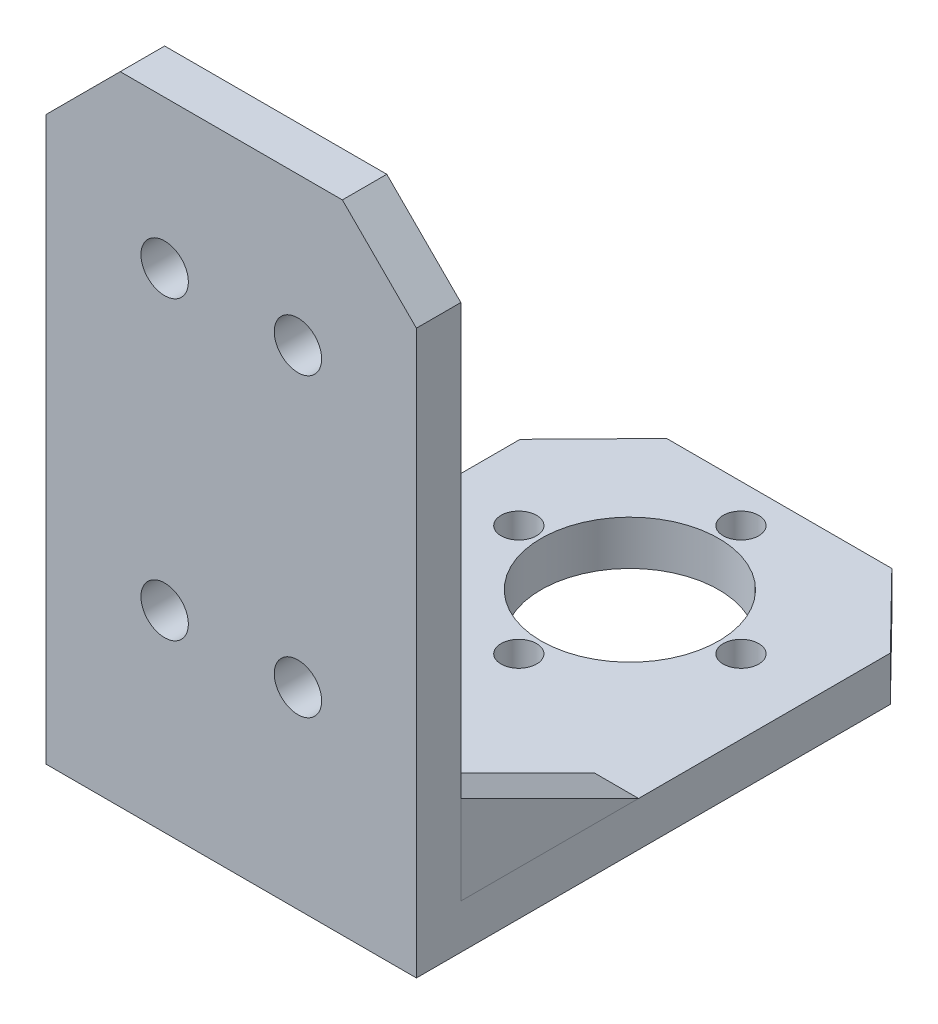
ISO-10303-21;
HEADER;
FILE_DESCRIPTION(('STEP AP214'),'2;1');
FILE_NAME('part.step','',(''),(''),'','','');
FILE_SCHEMA(('AUTOMOTIVE_DESIGN { 1 0 10303 214 1 1 1 1 }'));
ENDSEC;
DATA;
#1=APPLICATION_CONTEXT('core data for automotive mechanical design processes');
#2=APPLICATION_PROTOCOL_DEFINITION('international standard','automotive_design',2000,#1);
#3=PRODUCT_CONTEXT('',#1,'mechanical');
#4=PRODUCT('Part','Part','',(#3));
#5=PRODUCT_RELATED_PRODUCT_CATEGORY('part','',(#4));
#6=PRODUCT_DEFINITION_FORMATION('','',#4);
#7=PRODUCT_DEFINITION_CONTEXT('part definition',#1,'design');
#8=PRODUCT_DEFINITION('design','',#6,#7);
#9=PRODUCT_DEFINITION_SHAPE('','',#8);
#10=(LENGTH_UNIT() NAMED_UNIT(*) SI_UNIT(.MILLI.,.METRE.));
#11=(NAMED_UNIT(*) PLANE_ANGLE_UNIT() SI_UNIT($,.RADIAN.));
#12=(NAMED_UNIT(*) SI_UNIT($,.STERADIAN.) SOLID_ANGLE_UNIT());
#13=UNCERTAINTY_MEASURE_WITH_UNIT(LENGTH_MEASURE(1.E-05),#10,'distance_accuracy_value','');
#14=(GEOMETRIC_REPRESENTATION_CONTEXT(3) GLOBAL_UNCERTAINTY_ASSIGNED_CONTEXT((#13)) GLOBAL_UNIT_ASSIGNED_CONTEXT((#10,
#11,#12)) REPRESENTATION_CONTEXT('',''));
#15=CARTESIAN_POINT('',(0.,0.,0.));
#16=DIRECTION('',(0.,0.,1.));
#17=DIRECTION('',(1.,0.,0.));
#18=AXIS2_PLACEMENT_3D('',#15,#16,#17);
#19=CARTESIAN_POINT('',(-28.2810708538973,9.,50.7219917810053));
#20=DIRECTION('',(0.,-0.894427190999916,0.447213595499958));
#21=DIRECTION('',(0.,-0.447213595499958,-0.894427190999916));
#22=AXIS2_PLACEMENT_3D('',#19,#20,#21);
#23=PLANE('',#22);
#24=DIRECTION('',(0.,-0.447213595499958,-0.894427190999916));
#25=VECTOR('',#24,1.);
#26=CARTESIAN_POINT('',(-25.2810708538973,9.,50.7219917810053));
#27=LINE('',#26,#25);
#28=CARTESIAN_POINT('',(-25.2810708538973,9.,50.7219917810053));
#29=VERTEX_POINT('',#28);
#30=CARTESIAN_POINT('',(-25.2810708538973,3.,38.7219917810053));
#31=VERTEX_POINT('',#30);
#32=EDGE_CURVE('E92',#29,#31,#27,.T.);
#33=ORIENTED_EDGE('',*,*,#32,.T.);
#34=DIRECTION('',(1.,0.,0.));
#35=VECTOR('',#34,1.);
#36=CARTESIAN_POINT('',(-28.2810708538973,3.,38.7219917810053));
#37=LINE('',#36,#35);
#38=CARTESIAN_POINT('',(-28.2810708538973,3.,38.7219917810053));
#39=VERTEX_POINT('',#38);
#40=EDGE_CURVE('E12',#39,#31,#37,.T.);
#41=ORIENTED_EDGE('',*,*,#40,.F.);
#42=DIRECTION('',(0.,-0.447213595499958,-0.894427190999916));
#43=VECTOR('',#42,1.);
#44=CARTESIAN_POINT('',(-28.2810708538973,9.,50.7219917810053));
#45=LINE('',#44,#43);
#46=CARTESIAN_POINT('',(-28.2810708538973,9.,50.7219917810053));
#47=VERTEX_POINT('',#46);
#48=EDGE_CURVE('E85',#47,#39,#45,.T.);
#49=ORIENTED_EDGE('',*,*,#48,.F.);
#50=DIRECTION('',(1.,0.,0.));
#51=VECTOR('',#50,1.);
#52=CARTESIAN_POINT('',(-28.2810708538973,9.,50.7219917810053));
#53=LINE('',#52,#51);
#54=EDGE_CURVE('E93',#47,#29,#53,.T.);
#55=ORIENTED_EDGE('',*,*,#54,.T.);
#56=EDGE_LOOP('',(#33,#41,#49,#55));
#57=FACE_BOUND('',#56,.T.);
#58=ADVANCED_FACE('F45',(#57),#23,.F.);
#59=CARTESIAN_POINT('',(-28.2810708538973,3.,50.7219917810053));
#60=DIRECTION('',(0.,1.,0.));
#61=DIRECTION('',(0.,0.,1.));
#62=AXIS2_PLACEMENT_3D('',#59,#60,#61);
#63=PLANE('',#62);
#64=DIRECTION('',(0.,0.,1.));
#65=VECTOR('',#64,1.);
#66=CARTESIAN_POINT('',(-25.2810708538973,3.,50.7219917810053));
#67=LINE('',#66,#65);
#68=CARTESIAN_POINT('',(-25.2810708538973,3.,50.7219917810053));
#69=VERTEX_POINT('',#68);
#70=EDGE_CURVE('E73',#31,#69,#67,.T.);
#71=ORIENTED_EDGE('',*,*,#70,.T.);
#72=DIRECTION('',(1.,0.,0.));
#73=VECTOR('',#72,1.);
#74=CARTESIAN_POINT('',(-28.2810708538973,3.,50.7219917810053));
#75=LINE('',#74,#73);
#76=CARTESIAN_POINT('',(-28.2810708538973,3.,50.7219917810053));
#77=VERTEX_POINT('',#76);
#78=EDGE_CURVE('E53',#77,#69,#75,.T.);
#79=ORIENTED_EDGE('',*,*,#78,.F.);
#80=DIRECTION('',(0.,0.,1.));
#81=VECTOR('',#80,1.);
#82=CARTESIAN_POINT('',(-28.2810708538973,3.,50.7219917810053));
#83=LINE('',#82,#81);
#84=EDGE_CURVE('E81',#39,#77,#83,.T.);
#85=ORIENTED_EDGE('',*,*,#84,.F.);
#86=ORIENTED_EDGE('',*,*,#40,.T.);
#87=EDGE_LOOP('',(#71,#79,#85,#86));
#88=FACE_BOUND('',#87,.T.);
#89=ADVANCED_FACE('F82',(#88),#63,.F.);
#90=CARTESIAN_POINT('',(-28.2810708538973,3.,50.7219917810053));
#91=DIRECTION('',(0.,0.,-1.));
#92=DIRECTION('',(-1.,0.,0.));
#93=AXIS2_PLACEMENT_3D('',#90,#91,#92);
#94=PLANE('',#93);
#95=DIRECTION('',(0.,1.,0.));
#96=VECTOR('',#95,1.);
#97=CARTESIAN_POINT('',(-25.2810708538973,3.,50.7219917810053));
#98=LINE('',#97,#96);
#99=EDGE_CURVE('E78',#69,#29,#98,.T.);
#100=ORIENTED_EDGE('',*,*,#99,.T.);
#101=ORIENTED_EDGE('',*,*,#54,.F.);
#102=DIRECTION('',(0.,1.,0.));
#103=VECTOR('',#102,1.);
#104=CARTESIAN_POINT('',(-28.2810708538973,3.,50.7219917810053));
#105=LINE('',#104,#103);
#106=EDGE_CURVE('E61',#77,#47,#105,.T.);
#107=ORIENTED_EDGE('',*,*,#106,.F.);
#108=ORIENTED_EDGE('',*,*,#78,.T.);
#109=EDGE_LOOP('',(#100,#101,#107,#108));
#110=FACE_BOUND('',#109,.T.);
#111=ADVANCED_FACE('F100',(#110),#94,.F.);
#112=CARTESIAN_POINT('',(-28.2810708538973,0.,0.));
#113=DIRECTION('',(1.,0.,0.));
#114=DIRECTION('',(0.,0.,-1.));
#115=AXIS2_PLACEMENT_3D('',#112,#113,#114);
#116=PLANE('',#115);
#117=ORIENTED_EDGE('',*,*,#48,.T.);
#118=ORIENTED_EDGE('',*,*,#84,.T.);
#119=ORIENTED_EDGE('',*,*,#106,.T.);
#120=EDGE_LOOP('',(#117,#118,#119));
#121=FACE_BOUND('',#120,.T.);
#122=ADVANCED_FACE('F88',(#121),#116,.F.);
#123=CARTESIAN_POINT('',(-25.2810708538973,0.,0.));
#124=DIRECTION('',(1.,0.,0.));
#125=DIRECTION('',(0.,0.,-1.));
#126=AXIS2_PLACEMENT_3D('',#123,#124,#125);
#127=PLANE('',#126);
#128=ORIENTED_EDGE('',*,*,#32,.F.);
#129=ORIENTED_EDGE('',*,*,#99,.F.);
#130=ORIENTED_EDGE('',*,*,#70,.F.);
#131=EDGE_LOOP('',(#128,#129,#130));
#132=FACE_BOUND('',#131,.T.);
#133=ADVANCED_FACE('F101',(#132),#127,.T.);
#134=CLOSED_SHELL('',(#58,#89,#111,#122,#133));
#135=MANIFOLD_SOLID_BREP('B2',#134);
#136=CARTESIAN_POINT('',(-47.2810708538973,3.,38.7219917810053));
#137=DIRECTION('',(0.,-0.894427190999916,0.447213595499958));
#138=DIRECTION('',(0.,-0.447213595499958,-0.894427190999916));
#139=AXIS2_PLACEMENT_3D('',#136,#137,#138);
#140=PLANE('',#139);
#141=DIRECTION('',(0.,0.447213595499958,0.894427190999916));
#142=VECTOR('',#141,1.);
#143=CARTESIAN_POINT('',(-50.2810708538973,3.,38.7219917810053));
#144=LINE('',#143,#142);
#145=CARTESIAN_POINT('',(-50.2810708538973,3.,38.7219917810053));
#146=VERTEX_POINT('',#145);
#147=CARTESIAN_POINT('',(-50.2810708538973,9.,50.7219917810053));
#148=VERTEX_POINT('',#147);
#149=EDGE_CURVE('E199',#146,#148,#144,.T.);
#150=ORIENTED_EDGE('',*,*,#149,.T.);
#151=DIRECTION('',(-1.,0.,0.));
#152=VECTOR('',#151,1.);
#153=CARTESIAN_POINT('',(-47.2810708538973,9.,50.7219917810053));
#154=LINE('',#153,#152);
#155=CARTESIAN_POINT('',(-47.2810708538973,9.,50.7219917810053));
#156=VERTEX_POINT('',#155);
#157=EDGE_CURVE('E43',#156,#148,#154,.T.);
#158=ORIENTED_EDGE('',*,*,#157,.F.);
#159=DIRECTION('',(0.,0.447213595499958,0.894427190999916));
#160=VECTOR('',#159,1.);
#161=CARTESIAN_POINT('',(-47.2810708538973,3.,38.7219917810053));
#162=LINE('',#161,#160);
#163=CARTESIAN_POINT('',(-47.2810708538973,3.,38.7219917810053));
#164=VERTEX_POINT('',#163);
#165=EDGE_CURVE('E192',#164,#156,#162,.T.);
#166=ORIENTED_EDGE('',*,*,#165,.F.);
#167=DIRECTION('',(-1.,0.,0.));
#168=VECTOR('',#167,1.);
#169=CARTESIAN_POINT('',(-47.2810708538973,3.,38.7219917810053));
#170=LINE('',#169,#168);
#171=EDGE_CURVE('E200',#164,#146,#170,.T.);
#172=ORIENTED_EDGE('',*,*,#171,.T.);
#173=EDGE_LOOP('',(#150,#158,#166,#172));
#174=FACE_BOUND('',#173,.T.);
#175=ADVANCED_FACE('F152',(#174),#140,.F.);
#176=CARTESIAN_POINT('',(-47.2810708538973,3.,50.7219917810053));
#177=DIRECTION('',(0.,0.,-1.));
#178=DIRECTION('',(-1.,0.,0.));
#179=AXIS2_PLACEMENT_3D('',#176,#177,#178);
#180=PLANE('',#179);
#181=DIRECTION('',(0.,-1.,0.));
#182=VECTOR('',#181,1.);
#183=CARTESIAN_POINT('',(-50.2810708538973,3.,50.7219917810053));
#184=LINE('',#183,#182);
#185=CARTESIAN_POINT('',(-50.2810708538973,3.,50.7219917810053));
#186=VERTEX_POINT('',#185);
#187=EDGE_CURVE('E180',#148,#186,#184,.T.);
#188=ORIENTED_EDGE('',*,*,#187,.T.);
#189=DIRECTION('',(-1.,0.,0.));
#190=VECTOR('',#189,1.);
#191=CARTESIAN_POINT('',(-47.2810708538973,3.,50.7219917810053));
#192=LINE('',#191,#190);
#193=CARTESIAN_POINT('',(-47.2810708538973,3.,50.7219917810053));
#194=VERTEX_POINT('',#193);
#195=EDGE_CURVE('E160',#194,#186,#192,.T.);
#196=ORIENTED_EDGE('',*,*,#195,.F.);
#197=DIRECTION('',(0.,-1.,0.));
#198=VECTOR('',#197,1.);
#199=CARTESIAN_POINT('',(-47.2810708538973,3.,50.7219917810053));
#200=LINE('',#199,#198);
#201=EDGE_CURVE('E188',#156,#194,#200,.T.);
#202=ORIENTED_EDGE('',*,*,#201,.F.);
#203=ORIENTED_EDGE('',*,*,#157,.T.);
#204=EDGE_LOOP('',(#188,#196,#202,#203));
#205=FACE_BOUND('',#204,.T.);
#206=ADVANCED_FACE('F189',(#205),#180,.F.);
#207=CARTESIAN_POINT('',(-47.2810708538973,3.,50.7219917810053));
#208=DIRECTION('',(0.,1.,0.));
#209=DIRECTION('',(0.,0.,1.));
#210=AXIS2_PLACEMENT_3D('',#207,#208,#209);
#211=PLANE('',#210);
#212=DIRECTION('',(0.,0.,-1.));
#213=VECTOR('',#212,1.);
#214=CARTESIAN_POINT('',(-50.2810708538973,3.,50.7219917810053));
#215=LINE('',#214,#213);
#216=EDGE_CURVE('E185',#186,#146,#215,.T.);
#217=ORIENTED_EDGE('',*,*,#216,.T.);
#218=ORIENTED_EDGE('',*,*,#171,.F.);
#219=DIRECTION('',(0.,0.,-1.));
#220=VECTOR('',#219,1.);
#221=CARTESIAN_POINT('',(-47.2810708538973,3.,50.7219917810053));
#222=LINE('',#221,#220);
#223=EDGE_CURVE('E168',#194,#164,#222,.T.);
#224=ORIENTED_EDGE('',*,*,#223,.F.);
#225=ORIENTED_EDGE('',*,*,#195,.T.);
#226=EDGE_LOOP('',(#217,#218,#224,#225));
#227=FACE_BOUND('',#226,.T.);
#228=ADVANCED_FACE('F207',(#227),#211,.F.);
#229=CARTESIAN_POINT('',(-47.2810708538973,0.,0.));
#230=DIRECTION('',(-1.,0.,0.));
#231=DIRECTION('',(0.,0.,1.));
#232=AXIS2_PLACEMENT_3D('',#229,#230,#231);
#233=PLANE('',#232);
#234=ORIENTED_EDGE('',*,*,#165,.T.);
#235=ORIENTED_EDGE('',*,*,#201,.T.);
#236=ORIENTED_EDGE('',*,*,#223,.T.);
#237=EDGE_LOOP('',(#234,#235,#236));
#238=FACE_BOUND('',#237,.T.);
#239=ADVANCED_FACE('F195',(#238),#233,.F.);
#240=CARTESIAN_POINT('',(-50.2810708538973,0.,0.));
#241=DIRECTION('',(-1.,0.,0.));
#242=DIRECTION('',(0.,0.,1.));
#243=AXIS2_PLACEMENT_3D('',#240,#241,#242);
#244=PLANE('',#243);
#245=ORIENTED_EDGE('',*,*,#149,.F.);
#246=ORIENTED_EDGE('',*,*,#216,.F.);
#247=ORIENTED_EDGE('',*,*,#187,.F.);
#248=EDGE_LOOP('',(#245,#246,#247));
#249=FACE_BOUND('',#248,.T.);
#250=ADVANCED_FACE('F208',(#249),#244,.T.);
#251=CLOSED_SHELL('',(#175,#206,#228,#239,#250));
#252=MANIFOLD_SOLID_BREP('B6',#251);
#253=CARTESIAN_POINT('',(0.,3.,0.));
#254=DIRECTION('',(0.,-1.,0.));
#255=DIRECTION('',(0.,0.,-1.));
#256=AXIS2_PLACEMENT_3D('',#253,#254,#255);
#257=PLANE('',#256);
#258=CARTESIAN_POINT('',(-30.2810708538972,3.,26.8074849511543));
#259=DIRECTION('',(0.,1.,0.));
#260=DIRECTION('',(0.,0.,1.));
#261=AXIS2_PLACEMENT_3D('',#258,#259,#260);
#262=CIRCLE('',#261,1.2);
#263=CARTESIAN_POINT('',(-30.2810708538972,3.,28.0074849511543));
#264=VERTEX_POINT('',#263);
#265=EDGE_CURVE('E352',#264,#264,#262,.T.);
#266=ORIENTED_EDGE('',*,*,#265,.F.);
#267=EDGE_LOOP('',(#266));
#268=FACE_BOUND('',#267,.T.);
#269=CARTESIAN_POINT('',(-37.7810708538972,3.,34.3074849511543));
#270=DIRECTION('',(0.,1.,0.));
#271=DIRECTION('',(0.,0.,1.));
#272=AXIS2_PLACEMENT_3D('',#269,#270,#271);
#273=CIRCLE('',#272,1.2);
#274=CARTESIAN_POINT('',(-37.7810708538972,3.,35.5074849511543));
#275=VERTEX_POINT('',#274);
#276=EDGE_CURVE('E360',#275,#275,#273,.T.);
#277=ORIENTED_EDGE('',*,*,#276,.F.);
#278=EDGE_LOOP('',(#277));
#279=FACE_BOUND('',#278,.T.);
#280=CARTESIAN_POINT('',(-45.2810708538972,3.,26.8074849511543));
#281=DIRECTION('',(0.,1.,0.));
#282=DIRECTION('',(0.,0.,1.));
#283=AXIS2_PLACEMENT_3D('',#280,#281,#282);
#284=CIRCLE('',#283,1.2);
#285=CARTESIAN_POINT('',(-45.2810708538972,3.,28.0074849511543));
#286=VERTEX_POINT('',#285);
#287=EDGE_CURVE('E366',#286,#286,#284,.T.);
#288=ORIENTED_EDGE('',*,*,#287,.F.);
#289=EDGE_LOOP('',(#288));
#290=FACE_BOUND('',#289,.T.);
#291=CARTESIAN_POINT('',(-37.7810708538972,3.,19.3074849511543));
#292=DIRECTION('',(0.,1.,0.));
#293=DIRECTION('',(0.,0.,1.));
#294=AXIS2_PLACEMENT_3D('',#291,#292,#293);
#295=CIRCLE('',#294,1.2);
#296=CARTESIAN_POINT('',(-37.7810708538972,3.,20.5074849511543));
#297=VERTEX_POINT('',#296);
#298=EDGE_CURVE('E372',#297,#297,#295,.T.);
#299=ORIENTED_EDGE('',*,*,#298,.F.);
#300=EDGE_LOOP('',(#299));
#301=FACE_BOUND('',#300,.T.);
#302=CARTESIAN_POINT('',(-37.7810708538972,3.,26.8074849511543));
#303=DIRECTION('',(0.,1.,0.));
#304=DIRECTION('',(0.,0.,1.));
#305=AXIS2_PLACEMENT_3D('',#302,#303,#304);
#306=CIRCLE('',#305,5.99999999999999);
#307=CARTESIAN_POINT('',(-37.7810708538972,3.,32.8074849511543));
#308=VERTEX_POINT('',#307);
#309=EDGE_CURVE('E378',#308,#308,#306,.T.);
#310=ORIENTED_EDGE('',*,*,#309,.F.);
#311=EDGE_LOOP('',(#310));
#312=FACE_BOUND('',#311,.T.);
#313=DIRECTION('',(-1.,0.,0.));
#314=VECTOR('',#313,1.);
#315=CARTESIAN_POINT('',(-50.2810708538973,3.,50.7219917810053));
#316=LINE('',#315,#314);
#317=CARTESIAN_POINT('',(-25.2810708538973,3.,50.7219917810053));
#318=VERTEX_POINT('',#317);
#319=CARTESIAN_POINT('',(-50.2810708538973,3.,50.7219917810053));
#320=VERTEX_POINT('',#319);
#321=EDGE_CURVE('E430',#318,#320,#316,.T.);
#322=ORIENTED_EDGE('',*,*,#321,.F.);
#323=DIRECTION('',(0.,0.,-1.));
#324=VECTOR('',#323,1.);
#325=CARTESIAN_POINT('',(-25.2810708538973,3.,21.7219917810053));
#326=LINE('',#325,#324);
#327=CARTESIAN_POINT('',(-25.2810708538973,3.,21.7219917810053));
#328=VERTEX_POINT('',#327);
#329=EDGE_CURVE('E347',#318,#328,#326,.T.);
#330=ORIENTED_EDGE('',*,*,#329,.T.);
#331=DIRECTION('',(-0.699854212223774,0.,-0.714285714285705));
#332=VECTOR('',#331,1.);
#333=CARTESIAN_POINT('',(-30.1800503394638,3.,16.7219917810053));
#334=LINE('',#333,#332);
#335=CARTESIAN_POINT('',(-30.1800503394638,3.,16.7219917810053));
#336=VERTEX_POINT('',#335);
#337=EDGE_CURVE('E389',#328,#336,#334,.T.);
#338=ORIENTED_EDGE('',*,*,#337,.T.);
#339=DIRECTION('',(-1.,0.,0.));
#340=VECTOR('',#339,1.);
#341=CARTESIAN_POINT('',(-30.1800503394638,3.,16.7219917810053));
#342=LINE('',#341,#340);
#343=CARTESIAN_POINT('',(-45.3820913683308,3.,16.7219917810053));
#344=VERTEX_POINT('',#343);
#345=EDGE_CURVE('E391',#336,#344,#342,.T.);
#346=ORIENTED_EDGE('',*,*,#345,.T.);
#347=DIRECTION('',(-0.699854212223774,0.,0.714285714285706));
#348=VECTOR('',#347,1.);
#349=CARTESIAN_POINT('',(-50.2810708538973,3.,21.7219917810053));
#350=LINE('',#349,#348);
#351=CARTESIAN_POINT('',(-50.2810708538973,3.,21.7219917810053));
#352=VERTEX_POINT('',#351);
#353=EDGE_CURVE('E393',#344,#352,#350,.T.);
#354=ORIENTED_EDGE('',*,*,#353,.T.);
#355=DIRECTION('',(0.,0.,1.));
#356=VECTOR('',#355,1.);
#357=CARTESIAN_POINT('',(-50.2810708538973,3.,21.7219917810053));
#358=LINE('',#357,#356);
#359=EDGE_CURVE('E384',#352,#320,#358,.T.);
#360=ORIENTED_EDGE('',*,*,#359,.T.);
#361=EDGE_LOOP('',(#322,#330,#338,#346,#354,#360));
#362=FACE_BOUND('',#361,.T.);
#363=ADVANCED_FACE('F251',(#268,#279,#290,#301,#312,#362),#257,.F.);
#364=CARTESIAN_POINT('',(0.,0.,0.));
#365=DIRECTION('',(0.,-1.,0.));
#366=DIRECTION('',(0.,0.,-1.));
#367=AXIS2_PLACEMENT_3D('',#364,#365,#366);
#368=PLANE('',#367);
#369=CARTESIAN_POINT('',(-37.7810708538972,0.,34.3074849511543));
#370=DIRECTION('',(0.,1.,0.));
#371=DIRECTION('',(0.,0.,1.));
#372=AXIS2_PLACEMENT_3D('',#369,#370,#371);
#373=CIRCLE('',#372,1.2);
#374=CARTESIAN_POINT('',(-37.7810708538972,0.,35.5074849511543));
#375=VERTEX_POINT('',#374);
#376=EDGE_CURVE('E358',#375,#375,#373,.T.);
#377=ORIENTED_EDGE('',*,*,#376,.T.);
#378=EDGE_LOOP('',(#377));
#379=FACE_BOUND('',#378,.T.);
#380=CARTESIAN_POINT('',(-37.7810708538972,0.,19.3074849511543));
#381=DIRECTION('',(0.,1.,0.));
#382=DIRECTION('',(0.,0.,1.));
#383=AXIS2_PLACEMENT_3D('',#380,#381,#382);
#384=CIRCLE('',#383,1.2);
#385=CARTESIAN_POINT('',(-37.7810708538972,0.,20.5074849511543));
#386=VERTEX_POINT('',#385);
#387=EDGE_CURVE('E369',#386,#386,#384,.T.);
#388=ORIENTED_EDGE('',*,*,#387,.T.);
#389=EDGE_LOOP('',(#388));
#390=FACE_BOUND('',#389,.T.);
#391=DIRECTION('',(0.,0.,1.));
#392=VECTOR('',#391,1.);
#393=CARTESIAN_POINT('',(-50.2810708538973,0.,21.7219917810053));
#394=LINE('',#393,#392);
#395=CARTESIAN_POINT('',(-50.2810708538973,0.,21.7219917810053));
#396=VERTEX_POINT('',#395);
#397=CARTESIAN_POINT('',(-50.2810708538973,0.,53.7219917810053));
#398=VERTEX_POINT('',#397);
#399=EDGE_CURVE('E381',#396,#398,#394,.T.);
#400=ORIENTED_EDGE('',*,*,#399,.F.);
#401=DIRECTION('',(-0.699854212223774,0.,0.714285714285706));
#402=VECTOR('',#401,1.);
#403=CARTESIAN_POINT('',(-50.2810708538973,0.,21.7219917810053));
#404=LINE('',#403,#402);
#405=CARTESIAN_POINT('',(-45.3820913683308,0.,16.7219917810053));
#406=VERTEX_POINT('',#405);
#407=EDGE_CURVE('E387',#406,#396,#404,.T.);
#408=ORIENTED_EDGE('',*,*,#407,.F.);
#409=DIRECTION('',(-1.,0.,0.));
#410=VECTOR('',#409,1.);
#411=CARTESIAN_POINT('',(-30.1800503394638,0.,16.7219917810053));
#412=LINE('',#411,#410);
#413=CARTESIAN_POINT('',(-30.1800503394638,0.,16.7219917810053));
#414=VERTEX_POINT('',#413);
#415=EDGE_CURVE('E405',#414,#406,#412,.T.);
#416=ORIENTED_EDGE('',*,*,#415,.F.);
#417=DIRECTION('',(-0.699854212223774,0.,-0.714285714285705));
#418=VECTOR('',#417,1.);
#419=CARTESIAN_POINT('',(-30.1800503394638,0.,16.7219917810053));
#420=LINE('',#419,#418);
#421=CARTESIAN_POINT('',(-25.2810708538973,0.,21.7219917810053));
#422=VERTEX_POINT('',#421);
#423=EDGE_CURVE('E403',#422,#414,#420,.T.);
#424=ORIENTED_EDGE('',*,*,#423,.F.);
#425=DIRECTION('',(0.,0.,-1.));
#426=VECTOR('',#425,1.);
#427=CARTESIAN_POINT('',(-25.2810708538973,0.,21.7219917810053));
#428=LINE('',#427,#426);
#429=CARTESIAN_POINT('',(-25.2810708538973,0.,53.7219917810053));
#430=VERTEX_POINT('',#429);
#431=EDGE_CURVE('E401',#430,#422,#428,.T.);
#432=ORIENTED_EDGE('',*,*,#431,.F.);
#433=DIRECTION('',(1.,0.,0.));
#434=VECTOR('',#433,1.);
#435=CARTESIAN_POINT('',(-25.2810708538973,0.,53.7219917810053));
#436=LINE('',#435,#434);
#437=EDGE_CURVE('E398',#398,#430,#436,.T.);
#438=ORIENTED_EDGE('',*,*,#437,.F.);
#439=EDGE_LOOP('',(#400,#408,#416,#424,#432,#438));
#440=FACE_BOUND('',#439,.T.);
#441=CARTESIAN_POINT('',(-37.7810708538972,0.,26.8074849511543));
#442=DIRECTION('',(0.,1.,0.));
#443=DIRECTION('',(0.,0.,1.));
#444=AXIS2_PLACEMENT_3D('',#441,#442,#443);
#445=CIRCLE('',#444,5.99999999999999);
#446=CARTESIAN_POINT('',(-37.7810708538972,0.,32.8074849511543));
#447=VERTEX_POINT('',#446);
#448=EDGE_CURVE('E375',#447,#447,#445,.T.);
#449=ORIENTED_EDGE('',*,*,#448,.T.);
#450=EDGE_LOOP('',(#449));
#451=FACE_BOUND('',#450,.T.);
#452=CARTESIAN_POINT('',(-45.2810708538972,0.,26.8074849511543));
#453=DIRECTION('',(0.,1.,0.));
#454=DIRECTION('',(0.,0.,1.));
#455=AXIS2_PLACEMENT_3D('',#452,#453,#454);
#456=CIRCLE('',#455,1.2);
#457=CARTESIAN_POINT('',(-45.2810708538972,0.,28.0074849511543));
#458=VERTEX_POINT('',#457);
#459=EDGE_CURVE('E363',#458,#458,#456,.T.);
#460=ORIENTED_EDGE('',*,*,#459,.T.);
#461=EDGE_LOOP('',(#460));
#462=FACE_BOUND('',#461,.T.);
#463=CARTESIAN_POINT('',(-30.2810708538972,0.,26.8074849511543));
#464=DIRECTION('',(0.,1.,0.));
#465=DIRECTION('',(0.,0.,1.));
#466=AXIS2_PLACEMENT_3D('',#463,#464,#465);
#467=CIRCLE('',#466,1.2);
#468=CARTESIAN_POINT('',(-30.2810708538972,0.,28.0074849511543));
#469=VERTEX_POINT('',#468);
#470=EDGE_CURVE('E348',#469,#469,#467,.T.);
#471=ORIENTED_EDGE('',*,*,#470,.T.);
#472=EDGE_LOOP('',(#471));
#473=FACE_BOUND('',#472,.T.);
#474=ADVANCED_FACE('F493',(#379,#390,#440,#451,#462,#473),#368,.T.);
#475=CARTESIAN_POINT('',(-50.2810708538973,3.,21.7219917810053));
#476=DIRECTION('',(1.,0.,0.));
#477=DIRECTION('',(0.,0.,-1.));
#478=AXIS2_PLACEMENT_3D('',#475,#476,#477);
#479=PLANE('',#478);
#480=DIRECTION('',(0.,-1.,0.));
#481=VECTOR('',#480,1.);
#482=CARTESIAN_POINT('',(-50.2810708538973,3.,53.7219917810053));
#483=LINE('',#482,#481);
#484=CARTESIAN_POINT('',(-50.2810708538972,38.,53.7219917810053));
#485=VERTEX_POINT('',#484);
#486=EDGE_CURVE('E421',#485,#398,#483,.T.);
#487=ORIENTED_EDGE('',*,*,#486,.F.);
#488=DIRECTION('',(0.,0.,-1.));
#489=VECTOR('',#488,1.);
#490=CARTESIAN_POINT('',(-50.2810708538972,38.,58.7219917810053));
#491=LINE('',#490,#489);
#492=CARTESIAN_POINT('',(-50.2810708538972,38.,50.7219917810053));
#493=VERTEX_POINT('',#492);
#494=EDGE_CURVE('E342',#485,#493,#491,.T.);
#495=ORIENTED_EDGE('',*,*,#494,.T.);
#496=DIRECTION('',(0.,-1.,0.));
#497=VECTOR('',#496,1.);
#498=CARTESIAN_POINT('',(-50.2810708538973,43.,50.7219917810053));
#499=LINE('',#498,#497);
#500=EDGE_CURVE('E349',#493,#320,#499,.T.);
#501=ORIENTED_EDGE('',*,*,#500,.T.);
#502=ORIENTED_EDGE('',*,*,#359,.F.);
#503=DIRECTION('',(0.,-1.,0.));
#504=VECTOR('',#503,1.);
#505=CARTESIAN_POINT('',(-50.2810708538973,3.,21.7219917810053));
#506=LINE('',#505,#504);
#507=EDGE_CURVE('E395',#352,#396,#506,.T.);
#508=ORIENTED_EDGE('',*,*,#507,.T.);
#509=ORIENTED_EDGE('',*,*,#399,.T.);
#510=EDGE_LOOP('',(#487,#495,#501,#502,#508,#509));
#511=FACE_BOUND('',#510,.T.);
#512=ADVANCED_FACE('F253',(#511),#479,.F.);
#513=CARTESIAN_POINT('',(-25.2810708538973,3.,53.7219917810053));
#514=DIRECTION('',(0.,0.,-1.));
#515=DIRECTION('',(-1.,0.,0.));
#516=AXIS2_PLACEMENT_3D('',#513,#514,#515);
#517=PLANE('',#516);
#518=CARTESIAN_POINT('',(-33.2810708538972,33.,53.7219917810053));
#519=DIRECTION('',(0.,0.,-1.));
#520=DIRECTION('',(-1.,0.,0.));
#521=AXIS2_PLACEMENT_3D('',#518,#519,#520);
#522=CIRCLE('',#521,1.6);
#523=CARTESIAN_POINT('',(-34.8810708538972,33.,53.7219917810053));
#524=VERTEX_POINT('',#523);
#525=EDGE_CURVE('E458',#524,#524,#522,.T.);
#526=ORIENTED_EDGE('',*,*,#525,.T.);
#527=EDGE_LOOP('',(#526));
#528=FACE_BOUND('',#527,.T.);
#529=CARTESIAN_POINT('',(-42.2810708538972,33.,53.7219917810053));
#530=DIRECTION('',(0.,0.,-1.));
#531=DIRECTION('',(-1.,0.,0.));
#532=AXIS2_PLACEMENT_3D('',#529,#530,#531);
#533=CIRCLE('',#532,1.6);
#534=CARTESIAN_POINT('',(-43.8810708538972,33.,53.7219917810053));
#535=VERTEX_POINT('',#534);
#536=EDGE_CURVE('E452',#535,#535,#533,.T.);
#537=ORIENTED_EDGE('',*,*,#536,.T.);
#538=EDGE_LOOP('',(#537));
#539=FACE_BOUND('',#538,.T.);
#540=CARTESIAN_POINT('',(-42.2810708538972,13.,53.7219917810053));
#541=DIRECTION('',(0.,0.,-1.));
#542=DIRECTION('',(-1.,0.,0.));
#543=AXIS2_PLACEMENT_3D('',#540,#541,#542);
#544=CIRCLE('',#543,1.6);
#545=CARTESIAN_POINT('',(-43.8810708538972,13.,53.7219917810053));
#546=VERTEX_POINT('',#545);
#547=EDGE_CURVE('E446',#546,#546,#544,.T.);
#548=ORIENTED_EDGE('',*,*,#547,.T.);
#549=EDGE_LOOP('',(#548));
#550=FACE_BOUND('',#549,.T.);
#551=CARTESIAN_POINT('',(-33.2810708538972,13.,53.7219917810053));
#552=DIRECTION('',(0.,0.,-1.));
#553=DIRECTION('',(-1.,0.,0.));
#554=AXIS2_PLACEMENT_3D('',#551,#552,#553);
#555=CIRCLE('',#554,1.6);
#556=CARTESIAN_POINT('',(-34.8810708538972,13.,53.7219917810053));
#557=VERTEX_POINT('',#556);
#558=EDGE_CURVE('E439',#557,#557,#555,.T.);
#559=ORIENTED_EDGE('',*,*,#558,.T.);
#560=EDGE_LOOP('',(#559));
#561=FACE_BOUND('',#560,.T.);
#562=DIRECTION('',(0.,-1.,0.));
#563=VECTOR('',#562,1.);
#564=CARTESIAN_POINT('',(-25.2810708538973,3.,53.7219917810053));
#565=LINE('',#564,#563);
#566=CARTESIAN_POINT('',(-25.2810708538972,38.,53.7219917810053));
#567=VERTEX_POINT('',#566);
#568=EDGE_CURVE('E419',#567,#430,#565,.T.);
#569=ORIENTED_EDGE('',*,*,#568,.F.);
#570=DIRECTION('',(-0.707106781186548,0.707106781186547,0.));
#571=VECTOR('',#570,1.);
#572=CARTESIAN_POINT('',(-7.78107085389724,20.5000000000001,53.7219917810053));
#573=LINE('',#572,#571);
#574=CARTESIAN_POINT('',(-30.2810708538972,43.,53.7219917810053));
#575=VERTEX_POINT('',#574);
#576=EDGE_CURVE('E328',#567,#575,#573,.T.);
#577=ORIENTED_EDGE('',*,*,#576,.T.);
#578=DIRECTION('',(1.,0.,0.));
#579=VECTOR('',#578,1.);
#580=CARTESIAN_POINT('',(-50.2810708538973,43.,53.7219917810053));
#581=LINE('',#580,#579);
#582=CARTESIAN_POINT('',(-45.2810708538972,43.,53.7219917810053));
#583=VERTEX_POINT('',#582);
#584=EDGE_CURVE('E426',#583,#575,#581,.T.);
#585=ORIENTED_EDGE('',*,*,#584,.F.);
#586=DIRECTION('',(-0.707106781186549,-0.707106781186547,0.));
#587=VECTOR('',#586,1.);
#588=CARTESIAN_POINT('',(-55.2810708538972,33.,53.7219917810053));
#589=LINE('',#588,#587);
#590=EDGE_CURVE('E273',#583,#485,#589,.T.);
#591=ORIENTED_EDGE('',*,*,#590,.T.);
#592=ORIENTED_EDGE('',*,*,#486,.T.);
#593=ORIENTED_EDGE('',*,*,#437,.T.);
#594=EDGE_LOOP('',(#569,#577,#585,#591,#592,#593));
#595=FACE_BOUND('',#594,.T.);
#596=ADVANCED_FACE('F428',(#528,#539,#550,#561,#595),#517,.F.);
#597=CARTESIAN_POINT('',(-25.2810708538973,3.,21.7219917810053));
#598=DIRECTION('',(-1.,0.,0.));
#599=DIRECTION('',(0.,0.,1.));
#600=AXIS2_PLACEMENT_3D('',#597,#598,#599);
#601=PLANE('',#600);
#602=DIRECTION('',(0.,-1.,0.));
#603=VECTOR('',#602,1.);
#604=CARTESIAN_POINT('',(-25.2810708538973,43.,50.7219917810053));
#605=LINE('',#604,#603);
#606=CARTESIAN_POINT('',(-25.2810708538972,38.,50.7219917810053));
#607=VERTEX_POINT('',#606);
#608=EDGE_CURVE('E337',#607,#318,#605,.T.);
#609=ORIENTED_EDGE('',*,*,#608,.F.);
#610=DIRECTION('',(0.,0.,-1.));
#611=VECTOR('',#610,1.);
#612=CARTESIAN_POINT('',(-25.2810708538972,38.,58.7219917810053));
#613=LINE('',#612,#611);
#614=EDGE_CURVE('E325',#567,#607,#613,.T.);
#615=ORIENTED_EDGE('',*,*,#614,.F.);
#616=ORIENTED_EDGE('',*,*,#568,.T.);
#617=ORIENTED_EDGE('',*,*,#431,.T.);
#618=DIRECTION('',(0.,-1.,0.));
#619=VECTOR('',#618,1.);
#620=CARTESIAN_POINT('',(-25.2810708538973,3.,21.7219917810053));
#621=LINE('',#620,#619);
#622=EDGE_CURVE('E416',#328,#422,#621,.T.);
#623=ORIENTED_EDGE('',*,*,#622,.F.);
#624=ORIENTED_EDGE('',*,*,#329,.F.);
#625=EDGE_LOOP('',(#609,#615,#616,#617,#623,#624));
#626=FACE_BOUND('',#625,.T.);
#627=ADVANCED_FACE('F345',(#626),#601,.F.);
#628=CARTESIAN_POINT('',(-30.1800503394638,3.,16.7219917810053));
#629=DIRECTION('',(-0.714285714285706,0.,0.699854212223774));
#630=DIRECTION('',(0.699854212223774,0.,0.714285714285706));
#631=AXIS2_PLACEMENT_3D('',#628,#629,#630);
#632=PLANE('',#631);
#633=ORIENTED_EDGE('',*,*,#423,.T.);
#634=DIRECTION('',(0.,-1.,0.));
#635=VECTOR('',#634,1.);
#636=CARTESIAN_POINT('',(-30.1800503394638,3.,16.7219917810053));
#637=LINE('',#636,#635);
#638=EDGE_CURVE('E413',#336,#414,#637,.T.);
#639=ORIENTED_EDGE('',*,*,#638,.F.);
#640=ORIENTED_EDGE('',*,*,#337,.F.);
#641=ORIENTED_EDGE('',*,*,#622,.T.);
#642=EDGE_LOOP('',(#633,#639,#640,#641));
#643=FACE_BOUND('',#642,.T.);
#644=ADVANCED_FACE('F491',(#643),#632,.F.);
#645=CARTESIAN_POINT('',(-30.1800503394638,3.,16.7219917810053));
#646=DIRECTION('',(0.,0.,1.));
#647=DIRECTION('',(1.,0.,0.));
#648=AXIS2_PLACEMENT_3D('',#645,#646,#647);
#649=PLANE('',#648);
#650=ORIENTED_EDGE('',*,*,#415,.T.);
#651=DIRECTION('',(0.,-1.,0.));
#652=VECTOR('',#651,1.);
#653=CARTESIAN_POINT('',(-45.3820913683308,3.,16.7219917810053));
#654=LINE('',#653,#652);
#655=EDGE_CURVE('E410',#344,#406,#654,.T.);
#656=ORIENTED_EDGE('',*,*,#655,.F.);
#657=ORIENTED_EDGE('',*,*,#345,.F.);
#658=ORIENTED_EDGE('',*,*,#638,.T.);
#659=EDGE_LOOP('',(#650,#656,#657,#658));
#660=FACE_BOUND('',#659,.T.);
#661=ADVANCED_FACE('F513',(#660),#649,.F.);
#662=CARTESIAN_POINT('',(-50.2810708538973,3.,21.7219917810053));
#663=DIRECTION('',(0.714285714285706,0.,0.699854212223774));
#664=DIRECTION('',(0.699854212223774,0.,-0.714285714285706));
#665=AXIS2_PLACEMENT_3D('',#662,#663,#664);
#666=PLANE('',#665);
#667=ORIENTED_EDGE('',*,*,#407,.T.);
#668=ORIENTED_EDGE('',*,*,#507,.F.);
#669=ORIENTED_EDGE('',*,*,#353,.F.);
#670=ORIENTED_EDGE('',*,*,#655,.T.);
#671=EDGE_LOOP('',(#667,#668,#669,#670));
#672=FACE_BOUND('',#671,.T.);
#673=ADVANCED_FACE('F510',(#672),#666,.F.);
#674=CARTESIAN_POINT('',(-37.7810708538972,3.,26.8074849511543));
#675=DIRECTION('',(0.,-1.,0.));
#676=DIRECTION('',(0.,0.,-1.));
#677=AXIS2_PLACEMENT_3D('',#674,#675,#676);
#678=CYLINDRICAL_SURFACE('',#677,5.99999999999999);
#679=ORIENTED_EDGE('',*,*,#309,.T.);
#680=EDGE_LOOP('',(#679));
#681=FACE_BOUND('',#680,.T.);
#682=ORIENTED_EDGE('',*,*,#448,.F.);
#683=EDGE_LOOP('',(#682));
#684=FACE_BOUND('',#683,.T.);
#685=ADVANCED_FACE('F507',(#681,#684),#678,.F.);
#686=CARTESIAN_POINT('',(-37.7810708538972,3.,19.3074849511543));
#687=DIRECTION('',(0.,-1.,0.));
#688=DIRECTION('',(0.,0.,-1.));
#689=AXIS2_PLACEMENT_3D('',#686,#687,#688);
#690=CYLINDRICAL_SURFACE('',#689,1.2);
#691=ORIENTED_EDGE('',*,*,#298,.T.);
#692=EDGE_LOOP('',(#691));
#693=FACE_BOUND('',#692,.T.);
#694=ORIENTED_EDGE('',*,*,#387,.F.);
#695=EDGE_LOOP('',(#694));
#696=FACE_BOUND('',#695,.T.);
#697=ADVANCED_FACE('F558',(#693,#696),#690,.F.);
#698=CARTESIAN_POINT('',(-45.2810708538972,3.,26.8074849511543));
#699=DIRECTION('',(0.,-1.,0.));
#700=DIRECTION('',(0.,0.,-1.));
#701=AXIS2_PLACEMENT_3D('',#698,#699,#700);
#702=CYLINDRICAL_SURFACE('',#701,1.2);
#703=ORIENTED_EDGE('',*,*,#287,.T.);
#704=EDGE_LOOP('',(#703));
#705=FACE_BOUND('',#704,.T.);
#706=ORIENTED_EDGE('',*,*,#459,.F.);
#707=EDGE_LOOP('',(#706));
#708=FACE_BOUND('',#707,.T.);
#709=ADVANCED_FACE('F555',(#705,#708),#702,.F.);
#710=CARTESIAN_POINT('',(-37.7810708538972,3.,34.3074849511543));
#711=DIRECTION('',(0.,-1.,0.));
#712=DIRECTION('',(0.,0.,-1.));
#713=AXIS2_PLACEMENT_3D('',#710,#711,#712);
#714=CYLINDRICAL_SURFACE('',#713,1.2);
#715=ORIENTED_EDGE('',*,*,#276,.T.);
#716=EDGE_LOOP('',(#715));
#717=FACE_BOUND('',#716,.T.);
#718=ORIENTED_EDGE('',*,*,#376,.F.);
#719=EDGE_LOOP('',(#718));
#720=FACE_BOUND('',#719,.T.);
#721=ADVANCED_FACE('F551',(#717,#720),#714,.F.);
#722=CARTESIAN_POINT('',(-30.2810708538972,3.,26.8074849511543));
#723=DIRECTION('',(0.,-1.,0.));
#724=DIRECTION('',(0.,0.,-1.));
#725=AXIS2_PLACEMENT_3D('',#722,#723,#724);
#726=CYLINDRICAL_SURFACE('',#725,1.2);
#727=ORIENTED_EDGE('',*,*,#265,.T.);
#728=EDGE_LOOP('',(#727));
#729=FACE_BOUND('',#728,.T.);
#730=ORIENTED_EDGE('',*,*,#470,.F.);
#731=EDGE_LOOP('',(#730));
#732=FACE_BOUND('',#731,.T.);
#733=ADVANCED_FACE('F470',(#729,#732),#726,.F.);
#734=CARTESIAN_POINT('',(-50.2810708538973,43.,50.7219917810053));
#735=DIRECTION('',(0.,0.,1.));
#736=DIRECTION('',(1.,0.,0.));
#737=AXIS2_PLACEMENT_3D('',#734,#735,#736);
#738=PLANE('',#737);
#739=CARTESIAN_POINT('',(-33.2810708538972,33.,50.7219917810053));
#740=DIRECTION('',(0.,0.,-1.));
#741=DIRECTION('',(-1.,0.,0.));
#742=AXIS2_PLACEMENT_3D('',#739,#740,#741);
#743=CIRCLE('',#742,1.6);
#744=CARTESIAN_POINT('',(-34.8810708538972,33.,50.7219917810053));
#745=VERTEX_POINT('',#744);
#746=EDGE_CURVE('E461',#745,#745,#743,.T.);
#747=ORIENTED_EDGE('',*,*,#746,.F.);
#748=EDGE_LOOP('',(#747));
#749=FACE_BOUND('',#748,.T.);
#750=CARTESIAN_POINT('',(-42.2810708538972,33.,50.7219917810053));
#751=DIRECTION('',(0.,0.,-1.));
#752=DIRECTION('',(-1.,0.,0.));
#753=AXIS2_PLACEMENT_3D('',#750,#751,#752);
#754=CIRCLE('',#753,1.6);
#755=CARTESIAN_POINT('',(-43.8810708538972,33.,50.7219917810053));
#756=VERTEX_POINT('',#755);
#757=EDGE_CURVE('E455',#756,#756,#754,.T.);
#758=ORIENTED_EDGE('',*,*,#757,.F.);
#759=EDGE_LOOP('',(#758));
#760=FACE_BOUND('',#759,.T.);
#761=CARTESIAN_POINT('',(-42.2810708538972,13.,50.7219917810053));
#762=DIRECTION('',(0.,0.,-1.));
#763=DIRECTION('',(-1.,0.,0.));
#764=AXIS2_PLACEMENT_3D('',#761,#762,#763);
#765=CIRCLE('',#764,1.6);
#766=CARTESIAN_POINT('',(-43.8810708538972,13.,50.7219917810053));
#767=VERTEX_POINT('',#766);
#768=EDGE_CURVE('E449',#767,#767,#765,.T.);
#769=ORIENTED_EDGE('',*,*,#768,.F.);
#770=EDGE_LOOP('',(#769));
#771=FACE_BOUND('',#770,.T.);
#772=CARTESIAN_POINT('',(-33.2810708538972,13.,50.7219917810053));
#773=DIRECTION('',(0.,0.,-1.));
#774=DIRECTION('',(-1.,0.,0.));
#775=AXIS2_PLACEMENT_3D('',#772,#773,#774);
#776=CIRCLE('',#775,1.6);
#777=CARTESIAN_POINT('',(-34.8810708538972,13.,50.7219917810053));
#778=VERTEX_POINT('',#777);
#779=EDGE_CURVE('E443',#778,#778,#776,.T.);
#780=ORIENTED_EDGE('',*,*,#779,.F.);
#781=EDGE_LOOP('',(#780));
#782=FACE_BOUND('',#781,.T.);
#783=DIRECTION('',(-1.,0.,0.));
#784=VECTOR('',#783,1.);
#785=CARTESIAN_POINT('',(-50.2810708538973,43.,50.7219917810053));
#786=LINE('',#785,#784);
#787=CARTESIAN_POINT('',(-30.2810708538972,43.,50.7219917810053));
#788=VERTEX_POINT('',#787);
#789=CARTESIAN_POINT('',(-45.2810708538972,43.,50.7219917810053));
#790=VERTEX_POINT('',#789);
#791=EDGE_CURVE('E341',#788,#790,#786,.T.);
#792=ORIENTED_EDGE('',*,*,#791,.F.);
#793=DIRECTION('',(-0.707106781186548,0.707106781186547,0.));
#794=VECTOR('',#793,1.);
#795=CARTESIAN_POINT('',(-25.2810708538972,38.,50.7219917810053));
#796=LINE('',#795,#794);
#797=EDGE_CURVE('E266',#607,#788,#796,.T.);
#798=ORIENTED_EDGE('',*,*,#797,.F.);
#799=ORIENTED_EDGE('',*,*,#608,.T.);
#800=ORIENTED_EDGE('',*,*,#321,.T.);
#801=ORIENTED_EDGE('',*,*,#500,.F.);
#802=DIRECTION('',(-0.707106781186548,-0.707106781186546,0.));
#803=VECTOR('',#802,1.);
#804=CARTESIAN_POINT('',(-45.2810708538972,43.,50.7219917810053));
#805=LINE('',#804,#803);
#806=EDGE_CURVE('E438',#790,#493,#805,.T.);
#807=ORIENTED_EDGE('',*,*,#806,.F.);
#808=EDGE_LOOP('',(#792,#798,#799,#800,#801,#807));
#809=FACE_BOUND('',#808,.T.);
#810=ADVANCED_FACE('F335',(#749,#760,#771,#782,#809),#738,.F.);
#811=CARTESIAN_POINT('',(0.,43.,0.));
#812=DIRECTION('',(0.,-1.,0.));
#813=DIRECTION('',(0.,0.,-1.));
#814=AXIS2_PLACEMENT_3D('',#811,#812,#813);
#815=PLANE('',#814);
#816=ORIENTED_EDGE('',*,*,#584,.T.);
#817=DIRECTION('',(0.,0.,-1.));
#818=VECTOR('',#817,1.);
#819=CARTESIAN_POINT('',(-30.2810708538972,43.,0.));
#820=LINE('',#819,#818);
#821=EDGE_CURVE('E150',#575,#788,#820,.T.);
#822=ORIENTED_EDGE('',*,*,#821,.T.);
#823=ORIENTED_EDGE('',*,*,#791,.T.);
#824=DIRECTION('',(0.,0.,1.));
#825=VECTOR('',#824,1.);
#826=CARTESIAN_POINT('',(-45.2810708538972,43.,0.));
#827=LINE('',#826,#825);
#828=EDGE_CURVE('E259',#790,#583,#827,.T.);
#829=ORIENTED_EDGE('',*,*,#828,.T.);
#830=EDGE_LOOP('',(#816,#822,#823,#829));
#831=FACE_BOUND('',#830,.T.);
#832=ADVANCED_FACE('F425',(#831),#815,.F.);
#833=CARTESIAN_POINT('',(-45.2810708538972,43.,58.7219917810053));
#834=DIRECTION('',(0.707106781186547,-0.707106781186549,0.));
#835=DIRECTION('',(0.707106781186549,0.707106781186547,0.));
#836=AXIS2_PLACEMENT_3D('',#833,#834,#835);
#837=PLANE('',#836);
#838=ORIENTED_EDGE('',*,*,#828,.F.);
#839=ORIENTED_EDGE('',*,*,#806,.T.);
#840=ORIENTED_EDGE('',*,*,#494,.F.);
#841=ORIENTED_EDGE('',*,*,#590,.F.);
#842=EDGE_LOOP('',(#838,#839,#840,#841));
#843=FACE_BOUND('',#842,.T.);
#844=ADVANCED_FACE('F539',(#843),#837,.F.);
#845=CARTESIAN_POINT('',(-25.2810708538972,38.,58.7219917810053));
#846=DIRECTION('',(-0.707106781186547,-0.707106781186548,0.));
#847=DIRECTION('',(0.707106781186548,-0.707106781186547,0.));
#848=AXIS2_PLACEMENT_3D('',#845,#846,#847);
#849=PLANE('',#848);
#850=ORIENTED_EDGE('',*,*,#614,.T.);
#851=ORIENTED_EDGE('',*,*,#797,.T.);
#852=ORIENTED_EDGE('',*,*,#821,.F.);
#853=ORIENTED_EDGE('',*,*,#576,.F.);
#854=EDGE_LOOP('',(#850,#851,#852,#853));
#855=FACE_BOUND('',#854,.T.);
#856=ADVANCED_FACE('F326',(#855),#849,.F.);
#857=CARTESIAN_POINT('',(-33.2810708538972,13.,50.7219917810053));
#858=DIRECTION('',(0.,0.,-1.));
#859=DIRECTION('',(-1.,0.,0.));
#860=AXIS2_PLACEMENT_3D('',#857,#858,#859);
#861=CYLINDRICAL_SURFACE('',#860,1.6);
#862=ORIENTED_EDGE('',*,*,#779,.T.);
#863=EDGE_LOOP('',(#862));
#864=FACE_BOUND('',#863,.T.);
#865=ORIENTED_EDGE('',*,*,#558,.F.);
#866=EDGE_LOOP('',(#865));
#867=FACE_BOUND('',#866,.T.);
#868=ADVANCED_FACE('F478',(#864,#867),#861,.F.);
#869=CARTESIAN_POINT('',(-42.2810708538972,13.,50.7219917810053));
#870=DIRECTION('',(0.,0.,-1.));
#871=DIRECTION('',(-1.,0.,0.));
#872=AXIS2_PLACEMENT_3D('',#869,#870,#871);
#873=CYLINDRICAL_SURFACE('',#872,1.6);
#874=ORIENTED_EDGE('',*,*,#768,.T.);
#875=EDGE_LOOP('',(#874));
#876=FACE_BOUND('',#875,.T.);
#877=ORIENTED_EDGE('',*,*,#547,.F.);
#878=EDGE_LOOP('',(#877));
#879=FACE_BOUND('',#878,.T.);
#880=ADVANCED_FACE('F481',(#876,#879),#873,.F.);
#881=CARTESIAN_POINT('',(-42.2810708538972,33.,50.7219917810053));
#882=DIRECTION('',(0.,0.,-1.));
#883=DIRECTION('',(-1.,0.,0.));
#884=AXIS2_PLACEMENT_3D('',#881,#882,#883);
#885=CYLINDRICAL_SURFACE('',#884,1.6);
#886=ORIENTED_EDGE('',*,*,#757,.T.);
#887=EDGE_LOOP('',(#886));
#888=FACE_BOUND('',#887,.T.);
#889=ORIENTED_EDGE('',*,*,#536,.F.);
#890=EDGE_LOOP('',(#889));
#891=FACE_BOUND('',#890,.T.);
#892=ADVANCED_FACE('F660',(#888,#891),#885,.F.);
#893=CARTESIAN_POINT('',(-33.2810708538972,33.,50.7219917810053));
#894=DIRECTION('',(0.,0.,-1.));
#895=DIRECTION('',(-1.,0.,0.));
#896=AXIS2_PLACEMENT_3D('',#893,#894,#895);
#897=CYLINDRICAL_SURFACE('',#896,1.6);
#898=ORIENTED_EDGE('',*,*,#746,.T.);
#899=EDGE_LOOP('',(#898));
#900=FACE_BOUND('',#899,.T.);
#901=ORIENTED_EDGE('',*,*,#525,.F.);
#902=EDGE_LOOP('',(#901));
#903=FACE_BOUND('',#902,.T.);
#904=ADVANCED_FACE('F465',(#900,#903),#897,.F.);
#905=CLOSED_SHELL('',(#363,#474,#512,#596,#627,#644,#661,#673,#685,#697,#709,#721,#733,#810,
#832,#844,#856,#868,#880,#892,#904));
#906=MANIFOLD_SOLID_BREP('B37',#905);
#907=ADVANCED_BREP_SHAPE_REPRESENTATION('',(#18,#135,#252,#906),#14);
#908=SHAPE_DEFINITION_REPRESENTATION(#9,#907);
ENDSEC;
END-ISO-10303-21;
